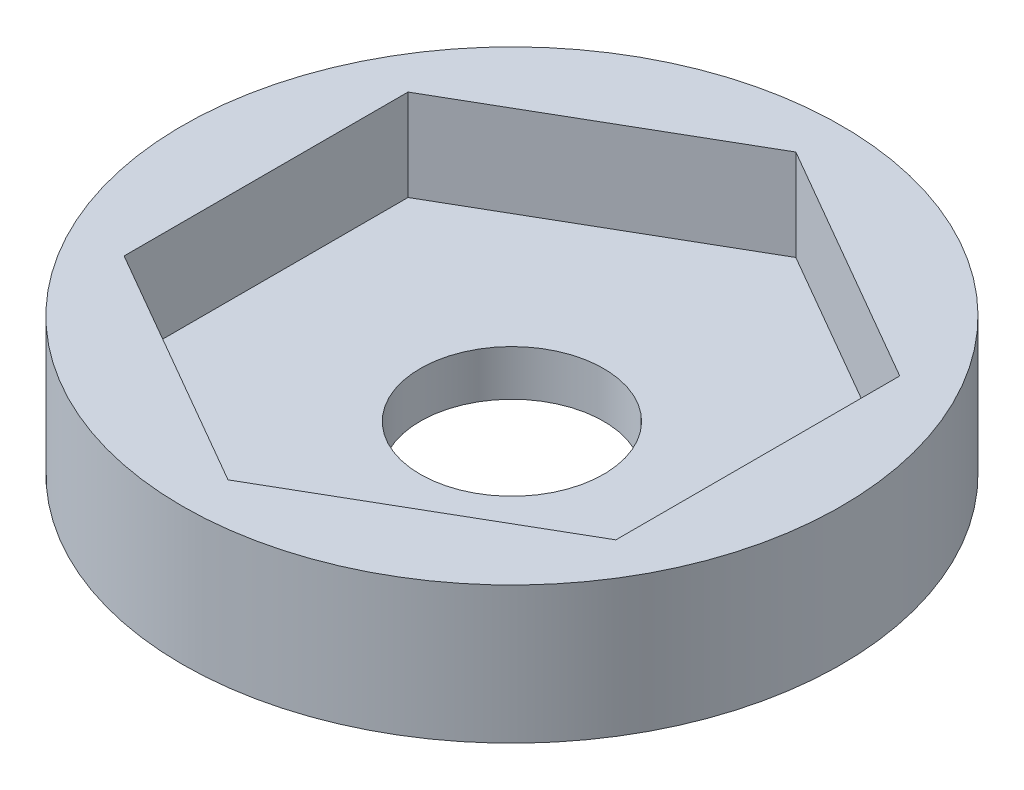
ISO-10303-21;
HEADER;
FILE_DESCRIPTION(('STEP AP214'),'2;1');
FILE_NAME('part.step','',(''),(''),'','','');
FILE_SCHEMA(('AUTOMOTIVE_DESIGN { 1 0 10303 214 1 1 1 1 }'));
ENDSEC;
DATA;
#1=APPLICATION_CONTEXT('core data for automotive mechanical design processes');
#2=APPLICATION_PROTOCOL_DEFINITION('international standard','automotive_design',2000,#1);
#3=PRODUCT_CONTEXT('',#1,'mechanical');
#4=PRODUCT('Part','Part','',(#3));
#5=PRODUCT_RELATED_PRODUCT_CATEGORY('part','',(#4));
#6=PRODUCT_DEFINITION_FORMATION('','',#4);
#7=PRODUCT_DEFINITION_CONTEXT('part definition',#1,'design');
#8=PRODUCT_DEFINITION('design','',#6,#7);
#9=PRODUCT_DEFINITION_SHAPE('','',#8);
#10=(LENGTH_UNIT() NAMED_UNIT(*) SI_UNIT(.MILLI.,.METRE.));
#11=(NAMED_UNIT(*) PLANE_ANGLE_UNIT() SI_UNIT($,.RADIAN.));
#12=(NAMED_UNIT(*) SI_UNIT($,.STERADIAN.) SOLID_ANGLE_UNIT());
#13=UNCERTAINTY_MEASURE_WITH_UNIT(LENGTH_MEASURE(1.E-05),#10,'distance_accuracy_value','');
#14=(GEOMETRIC_REPRESENTATION_CONTEXT(3) GLOBAL_UNCERTAINTY_ASSIGNED_CONTEXT((#13)) GLOBAL_UNIT_ASSIGNED_CONTEXT((#10,
#11,#12)) REPRESENTATION_CONTEXT('',''));
#15=CARTESIAN_POINT('',(0.,0.,0.));
#16=DIRECTION('',(0.,0.,1.));
#17=DIRECTION('',(1.,0.,0.));
#18=AXIS2_PLACEMENT_3D('',#15,#16,#17);
#19=CARTESIAN_POINT('',(0.,3.175,0.));
#20=DIRECTION('',(0.,1.,0.));
#21=DIRECTION('',(0.,0.,1.));
#22=AXIS2_PLACEMENT_3D('',#19,#20,#21);
#23=PLANE('',#22);
#24=CARTESIAN_POINT('',(0.,3.175,0.));
#25=DIRECTION('',(0.,1.,0.));
#26=DIRECTION('',(0.,0.,1.));
#27=AXIS2_PLACEMENT_3D('',#24,#25,#26);
#28=CIRCLE('',#27,11.4568409715813);
#29=CARTESIAN_POINT('',(0.,3.175,11.4568409715813));
#30=VERTEX_POINT('',#29);
#31=EDGE_CURVE('E11',#30,#30,#28,.T.);
#32=ORIENTED_EDGE('',*,*,#31,.T.);
#33=EDGE_LOOP('',(#32));
#34=FACE_BOUND('',#33,.T.);
#35=DIRECTION('',(-0.866025403784438,0.,-0.5));
#36=VECTOR('',#35,1.);
#37=CARTESIAN_POINT('',(8.5471,3.175,-4.93467048579065));
#38=LINE('',#37,#36);
#39=CARTESIAN_POINT('',(8.5471,3.175,-4.93467048579065));
#40=VERTEX_POINT('',#39);
#41=CARTESIAN_POINT('',(0.,3.175,-9.8693409715813));
#42=VERTEX_POINT('',#41);
#43=EDGE_CURVE('E105',#40,#42,#38,.T.);
#44=ORIENTED_EDGE('',*,*,#43,.F.);
#45=DIRECTION('',(0.,0.,-1.));
#46=VECTOR('',#45,1.);
#47=CARTESIAN_POINT('',(8.5471,3.175,4.93467048579065));
#48=LINE('',#47,#46);
#49=CARTESIAN_POINT('',(8.5471,3.175,4.93467048579065));
#50=VERTEX_POINT('',#49);
#51=EDGE_CURVE('E85',#50,#40,#48,.T.);
#52=ORIENTED_EDGE('',*,*,#51,.F.);
#53=DIRECTION('',(0.866025403784439,0.,-0.5));
#54=VECTOR('',#53,1.);
#55=CARTESIAN_POINT('',(0.,3.175,9.8693409715813));
#56=LINE('',#55,#54);
#57=CARTESIAN_POINT('',(0.,3.175,9.8693409715813));
#58=VERTEX_POINT('',#57);
#59=EDGE_CURVE('E56',#58,#50,#56,.T.);
#60=ORIENTED_EDGE('',*,*,#59,.F.);
#61=DIRECTION('',(0.866025403784439,0.,0.5));
#62=VECTOR('',#61,1.);
#63=CARTESIAN_POINT('',(-8.5471,3.175,4.93467048579065));
#64=LINE('',#63,#62);
#65=CARTESIAN_POINT('',(-8.5471,3.175,4.93467048579065));
#66=VERTEX_POINT('',#65);
#67=EDGE_CURVE('E116',#66,#58,#64,.T.);
#68=ORIENTED_EDGE('',*,*,#67,.F.);
#69=DIRECTION('',(0.,0.,1.));
#70=VECTOR('',#69,1.);
#71=CARTESIAN_POINT('',(-8.5471,3.175,-4.93467048579066));
#72=LINE('',#71,#70);
#73=CARTESIAN_POINT('',(-8.5471,3.175,-4.93467048579066));
#74=VERTEX_POINT('',#73);
#75=EDGE_CURVE('E104',#74,#66,#72,.T.);
#76=ORIENTED_EDGE('',*,*,#75,.F.);
#77=DIRECTION('',(-0.866025403784439,0.,0.5));
#78=VECTOR('',#77,1.);
#79=CARTESIAN_POINT('',(0.,3.175,-9.8693409715813));
#80=LINE('',#79,#78);
#81=EDGE_CURVE('E94',#42,#74,#80,.T.);
#82=ORIENTED_EDGE('',*,*,#81,.F.);
#83=EDGE_LOOP('',(#44,#52,#60,#68,#76,#82));
#84=FACE_BOUND('',#83,.T.);
#85=ADVANCED_FACE('F35',(#34,#84),#23,.T.);
#86=CARTESIAN_POINT('',(0.,3.175,0.));
#87=DIRECTION('',(0.,-1.,0.));
#88=DIRECTION('',(0.,0.,-1.));
#89=AXIS2_PLACEMENT_3D('',#86,#87,#88);
#90=CYLINDRICAL_SURFACE('',#89,11.4568409715813);
#91=ORIENTED_EDGE('',*,*,#31,.F.);
#92=EDGE_LOOP('',(#91));
#93=FACE_BOUND('',#92,.T.);
#94=CARTESIAN_POINT('',(0.,-1.5875,0.));
#95=DIRECTION('',(0.,1.,0.));
#96=DIRECTION('',(0.,0.,1.));
#97=AXIS2_PLACEMENT_3D('',#94,#95,#96);
#98=CIRCLE('',#97,11.4568409715813);
#99=CARTESIAN_POINT('',(0.,-1.5875,11.4568409715813));
#100=VERTEX_POINT('',#99);
#101=EDGE_CURVE('E127',#100,#100,#98,.T.);
#102=ORIENTED_EDGE('',*,*,#101,.T.);
#103=EDGE_LOOP('',(#102));
#104=FACE_BOUND('',#103,.T.);
#105=ADVANCED_FACE('F37',(#93,#104),#90,.T.);
#106=CARTESIAN_POINT('',(8.5471,3.175,4.93467048579065));
#107=DIRECTION('',(-1.,0.,0.));
#108=DIRECTION('',(0.,0.,1.));
#109=AXIS2_PLACEMENT_3D('',#106,#107,#108);
#110=PLANE('',#109);
#111=DIRECTION('',(0.,0.,-1.));
#112=VECTOR('',#111,1.);
#113=CARTESIAN_POINT('',(8.5471,0.,4.93467048579065));
#114=LINE('',#113,#112);
#115=CARTESIAN_POINT('',(8.5471,0.,4.93467048579065));
#116=VERTEX_POINT('',#115);
#117=CARTESIAN_POINT('',(8.5471,0.,-4.93467048579065));
#118=VERTEX_POINT('',#117);
#119=EDGE_CURVE('E123',#116,#118,#114,.T.);
#120=ORIENTED_EDGE('',*,*,#119,.F.);
#121=DIRECTION('',(0.,-1.,0.));
#122=VECTOR('',#121,1.);
#123=CARTESIAN_POINT('',(8.5471,3.175,4.93467048579065));
#124=LINE('',#123,#122);
#125=EDGE_CURVE('E122',#50,#116,#124,.T.);
#126=ORIENTED_EDGE('',*,*,#125,.F.);
#127=ORIENTED_EDGE('',*,*,#51,.T.);
#128=DIRECTION('',(0.,-1.,0.));
#129=VECTOR('',#128,1.);
#130=CARTESIAN_POINT('',(8.5471,3.175,-4.93467048579065));
#131=LINE('',#130,#129);
#132=EDGE_CURVE('E43',#40,#118,#131,.T.);
#133=ORIENTED_EDGE('',*,*,#132,.T.);
#134=EDGE_LOOP('',(#120,#126,#127,#133));
#135=FACE_BOUND('',#134,.T.);
#136=ADVANCED_FACE('F143',(#135),#110,.T.);
#137=CARTESIAN_POINT('',(8.5471,3.175,-4.93467048579065));
#138=DIRECTION('',(-0.5,0.,0.866025403784438));
#139=DIRECTION('',(0.866025403784439,0.,0.5));
#140=AXIS2_PLACEMENT_3D('',#137,#138,#139);
#141=PLANE('',#140);
#142=DIRECTION('',(-0.866025403784438,0.,-0.5));
#143=VECTOR('',#142,1.);
#144=CARTESIAN_POINT('',(8.5471,0.,-4.93467048579065));
#145=LINE('',#144,#143);
#146=CARTESIAN_POINT('',(0.,0.,-9.8693409715813));
#147=VERTEX_POINT('',#146);
#148=EDGE_CURVE('E126',#118,#147,#145,.T.);
#149=ORIENTED_EDGE('',*,*,#148,.F.);
#150=ORIENTED_EDGE('',*,*,#132,.F.);
#151=ORIENTED_EDGE('',*,*,#43,.T.);
#152=DIRECTION('',(0.,-1.,0.));
#153=VECTOR('',#152,1.);
#154=CARTESIAN_POINT('',(0.,3.175,-9.8693409715813));
#155=LINE('',#154,#153);
#156=EDGE_CURVE('E100',#42,#147,#155,.T.);
#157=ORIENTED_EDGE('',*,*,#156,.T.);
#158=EDGE_LOOP('',(#149,#150,#151,#157));
#159=FACE_BOUND('',#158,.T.);
#160=ADVANCED_FACE('F184',(#159),#141,.T.);
#161=CARTESIAN_POINT('',(0.,3.175,-9.8693409715813));
#162=DIRECTION('',(0.5,0.,0.866025403784439));
#163=DIRECTION('',(0.866025403784439,0.,-0.5));
#164=AXIS2_PLACEMENT_3D('',#161,#162,#163);
#165=PLANE('',#164);
#166=DIRECTION('',(-0.866025403784439,0.,0.5));
#167=VECTOR('',#166,1.);
#168=CARTESIAN_POINT('',(0.,0.,-9.8693409715813));
#169=LINE('',#168,#167);
#170=CARTESIAN_POINT('',(-8.5471,0.,-4.93467048579066));
#171=VERTEX_POINT('',#170);
#172=EDGE_CURVE('E130',#147,#171,#169,.T.);
#173=ORIENTED_EDGE('',*,*,#172,.F.);
#174=ORIENTED_EDGE('',*,*,#156,.F.);
#175=ORIENTED_EDGE('',*,*,#81,.T.);
#176=DIRECTION('',(0.,-1.,0.));
#177=VECTOR('',#176,1.);
#178=CARTESIAN_POINT('',(-8.5471,3.175,-4.93467048579066));
#179=LINE('',#178,#177);
#180=EDGE_CURVE('E98',#74,#171,#179,.T.);
#181=ORIENTED_EDGE('',*,*,#180,.T.);
#182=EDGE_LOOP('',(#173,#174,#175,#181));
#183=FACE_BOUND('',#182,.T.);
#184=ADVANCED_FACE('F97',(#183),#165,.T.);
#185=CARTESIAN_POINT('',(-8.5471,3.175,-4.93467048579066));
#186=DIRECTION('',(1.,0.,0.));
#187=DIRECTION('',(0.,0.,-1.));
#188=AXIS2_PLACEMENT_3D('',#185,#186,#187);
#189=PLANE('',#188);
#190=DIRECTION('',(0.,0.,1.));
#191=VECTOR('',#190,1.);
#192=CARTESIAN_POINT('',(-8.5471,0.,-4.93467048579066));
#193=LINE('',#192,#191);
#194=CARTESIAN_POINT('',(-8.5471,0.,4.93467048579065));
#195=VERTEX_POINT('',#194);
#196=EDGE_CURVE('E111',#171,#195,#193,.T.);
#197=ORIENTED_EDGE('',*,*,#196,.F.);
#198=ORIENTED_EDGE('',*,*,#180,.F.);
#199=ORIENTED_EDGE('',*,*,#75,.T.);
#200=DIRECTION('',(0.,-1.,0.));
#201=VECTOR('',#200,1.);
#202=CARTESIAN_POINT('',(-8.5471,3.175,4.93467048579065));
#203=LINE('',#202,#201);
#204=EDGE_CURVE('E113',#66,#195,#203,.T.);
#205=ORIENTED_EDGE('',*,*,#204,.T.);
#206=EDGE_LOOP('',(#197,#198,#199,#205));
#207=FACE_BOUND('',#206,.T.);
#208=ADVANCED_FACE('F108',(#207),#189,.T.);
#209=CARTESIAN_POINT('',(-8.5471,3.175,4.93467048579065));
#210=DIRECTION('',(0.5,0.,-0.866025403784439));
#211=DIRECTION('',(-0.866025403784439,0.,-0.5));
#212=AXIS2_PLACEMENT_3D('',#209,#210,#211);
#213=PLANE('',#212);
#214=DIRECTION('',(0.866025403784439,0.,0.5));
#215=VECTOR('',#214,1.);
#216=CARTESIAN_POINT('',(-8.5471,0.,4.93467048579065));
#217=LINE('',#216,#215);
#218=CARTESIAN_POINT('',(0.,0.,9.8693409715813));
#219=VERTEX_POINT('',#218);
#220=EDGE_CURVE('E133',#195,#219,#217,.T.);
#221=ORIENTED_EDGE('',*,*,#220,.F.);
#222=ORIENTED_EDGE('',*,*,#204,.F.);
#223=ORIENTED_EDGE('',*,*,#67,.T.);
#224=DIRECTION('',(0.,-1.,0.));
#225=VECTOR('',#224,1.);
#226=CARTESIAN_POINT('',(0.,3.175,9.8693409715813));
#227=LINE('',#226,#225);
#228=EDGE_CURVE('E50',#58,#219,#227,.T.);
#229=ORIENTED_EDGE('',*,*,#228,.T.);
#230=EDGE_LOOP('',(#221,#222,#223,#229));
#231=FACE_BOUND('',#230,.T.);
#232=ADVANCED_FACE('F191',(#231),#213,.T.);
#233=CARTESIAN_POINT('',(0.,3.175,9.8693409715813));
#234=DIRECTION('',(-0.5,0.,-0.866025403784439));
#235=DIRECTION('',(-0.866025403784439,0.,0.5));
#236=AXIS2_PLACEMENT_3D('',#233,#234,#235);
#237=PLANE('',#236);
#238=DIRECTION('',(0.866025403784439,0.,-0.5));
#239=VECTOR('',#238,1.);
#240=CARTESIAN_POINT('',(0.,0.,9.8693409715813));
#241=LINE('',#240,#239);
#242=EDGE_CURVE('E136',#219,#116,#241,.T.);
#243=ORIENTED_EDGE('',*,*,#242,.F.);
#244=ORIENTED_EDGE('',*,*,#228,.F.);
#245=ORIENTED_EDGE('',*,*,#59,.T.);
#246=ORIENTED_EDGE('',*,*,#125,.T.);
#247=EDGE_LOOP('',(#243,#244,#245,#246));
#248=FACE_BOUND('',#247,.T.);
#249=ADVANCED_FACE('F148',(#248),#237,.T.);
#250=CARTESIAN_POINT('',(0.,-1.5875,0.));
#251=DIRECTION('',(0.,1.,0.));
#252=DIRECTION('',(0.,0.,1.));
#253=AXIS2_PLACEMENT_3D('',#250,#251,#252);
#254=PLANE('',#253);
#255=CARTESIAN_POINT('',(0.,-1.5875,0.));
#256=DIRECTION('',(0.,1.,0.));
#257=DIRECTION('',(0.,0.,1.));
#258=AXIS2_PLACEMENT_3D('',#255,#256,#257);
#259=CIRCLE('',#258,3.1877);
#260=CARTESIAN_POINT('',(0.,-1.5875,3.1877));
#261=VERTEX_POINT('',#260);
#262=EDGE_CURVE('E153',#261,#261,#259,.T.);
#263=ORIENTED_EDGE('',*,*,#262,.T.);
#264=EDGE_LOOP('',(#263));
#265=FACE_BOUND('',#264,.T.);
#266=ORIENTED_EDGE('',*,*,#101,.F.);
#267=EDGE_LOOP('',(#266));
#268=FACE_BOUND('',#267,.T.);
#269=ADVANCED_FACE('F160',(#265,#268),#254,.F.);
#270=CARTESIAN_POINT('',(0.,0.,0.));
#271=DIRECTION('',(0.,1.,0.));
#272=DIRECTION('',(0.,0.,1.));
#273=AXIS2_PLACEMENT_3D('',#270,#271,#272);
#274=PLANE('',#273);
#275=ORIENTED_EDGE('',*,*,#242,.T.);
#276=ORIENTED_EDGE('',*,*,#119,.T.);
#277=ORIENTED_EDGE('',*,*,#148,.T.);
#278=ORIENTED_EDGE('',*,*,#172,.T.);
#279=ORIENTED_EDGE('',*,*,#196,.T.);
#280=ORIENTED_EDGE('',*,*,#220,.T.);
#281=EDGE_LOOP('',(#275,#276,#277,#278,#279,#280));
#282=FACE_BOUND('',#281,.T.);
#283=CARTESIAN_POINT('',(0.,0.,0.));
#284=DIRECTION('',(0.,1.,0.));
#285=DIRECTION('',(0.,0.,1.));
#286=AXIS2_PLACEMENT_3D('',#283,#284,#285);
#287=CIRCLE('',#286,3.1877);
#288=CARTESIAN_POINT('',(0.,0.,3.1877));
#289=VERTEX_POINT('',#288);
#290=EDGE_CURVE('E154',#289,#289,#287,.T.);
#291=ORIENTED_EDGE('',*,*,#290,.F.);
#292=EDGE_LOOP('',(#291));
#293=FACE_BOUND('',#292,.T.);
#294=ADVANCED_FACE('F146',(#282,#293),#274,.T.);
#295=CARTESIAN_POINT('',(0.,-1.5875,0.));
#296=DIRECTION('',(0.,1.,0.));
#297=DIRECTION('',(0.,0.,1.));
#298=AXIS2_PLACEMENT_3D('',#295,#296,#297);
#299=CYLINDRICAL_SURFACE('',#298,3.1877);
#300=ORIENTED_EDGE('',*,*,#262,.F.);
#301=EDGE_LOOP('',(#300));
#302=FACE_BOUND('',#301,.T.);
#303=ORIENTED_EDGE('',*,*,#290,.T.);
#304=EDGE_LOOP('',(#303));
#305=FACE_BOUND('',#304,.T.);
#306=ADVANCED_FACE('F163',(#302,#305),#299,.F.);
#307=CLOSED_SHELL('',(#85,#105,#136,#160,#184,#208,#232,#249,#269,#294,#306));
#308=MANIFOLD_SOLID_BREP('B2',#307);
#309=ADVANCED_BREP_SHAPE_REPRESENTATION('',(#18,#308),#14);
#310=SHAPE_DEFINITION_REPRESENTATION(#9,#309);
ENDSEC;
END-ISO-10303-21;
